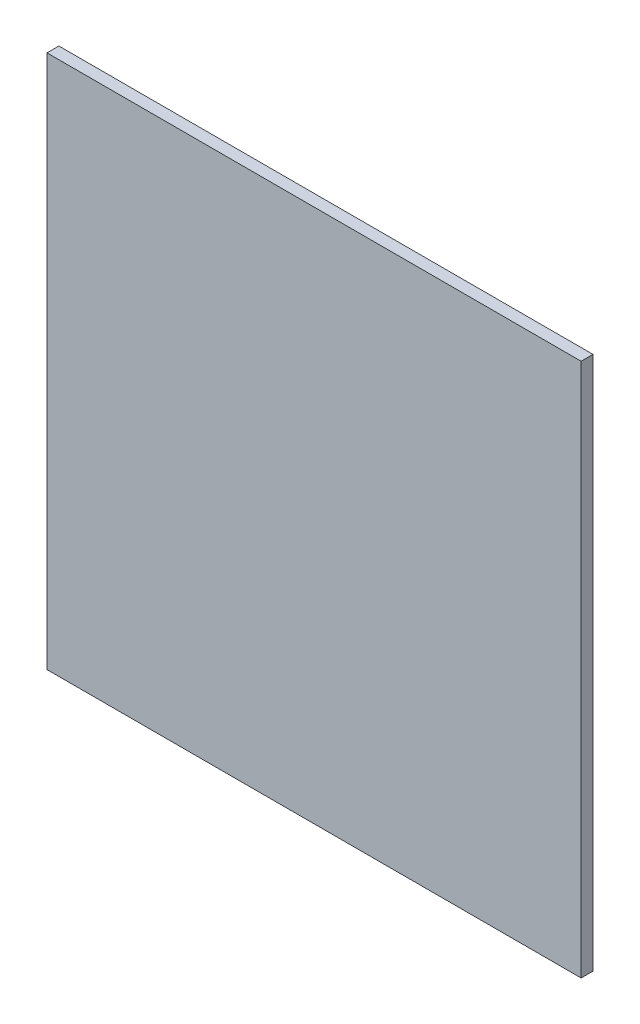
ISO-10303-21;
HEADER;
FILE_DESCRIPTION(('STEP AP214'),'2;1');
FILE_NAME('part.step','',(''),(''),'','','');
FILE_SCHEMA(('AUTOMOTIVE_DESIGN { 1 0 10303 214 1 1 1 1 }'));
ENDSEC;
DATA;
#1=APPLICATION_CONTEXT('core data for automotive mechanical design processes');
#2=APPLICATION_PROTOCOL_DEFINITION('international standard','automotive_design',2000,#1);
#3=PRODUCT_CONTEXT('',#1,'mechanical');
#4=PRODUCT('Part','Part','',(#3));
#5=PRODUCT_RELATED_PRODUCT_CATEGORY('part','',(#4));
#6=PRODUCT_DEFINITION_FORMATION('','',#4);
#7=PRODUCT_DEFINITION_CONTEXT('part definition',#1,'design');
#8=PRODUCT_DEFINITION('design','',#6,#7);
#9=PRODUCT_DEFINITION_SHAPE('','',#8);
#10=(LENGTH_UNIT() NAMED_UNIT(*) SI_UNIT(.MILLI.,.METRE.));
#11=(NAMED_UNIT(*) PLANE_ANGLE_UNIT() SI_UNIT($,.RADIAN.));
#12=(NAMED_UNIT(*) SI_UNIT($,.STERADIAN.) SOLID_ANGLE_UNIT());
#13=UNCERTAINTY_MEASURE_WITH_UNIT(LENGTH_MEASURE(1.E-05),#10,'distance_accuracy_value','');
#14=(GEOMETRIC_REPRESENTATION_CONTEXT(3) GLOBAL_UNCERTAINTY_ASSIGNED_CONTEXT((#13)) GLOBAL_UNIT_ASSIGNED_CONTEXT((#10,
#11,#12)) REPRESENTATION_CONTEXT('',''));
#15=CARTESIAN_POINT('',(0.,0.,0.));
#16=DIRECTION('',(0.,0.,1.));
#17=DIRECTION('',(1.,0.,0.));
#18=AXIS2_PLACEMENT_3D('',#15,#16,#17);
#19=CARTESIAN_POINT('',(22.5,-22.5,1.));
#20=DIRECTION('',(-1.,0.,0.));
#21=DIRECTION('',(0.,0.,1.));
#22=AXIS2_PLACEMENT_3D('',#19,#20,#21);
#23=PLANE('',#22);
#24=DIRECTION('',(0.,1.,0.));
#25=VECTOR('',#24,1.);
#26=CARTESIAN_POINT('',(22.5,-22.5,0.));
#27=LINE('',#26,#25);
#28=CARTESIAN_POINT('',(22.5,-22.5,0.));
#29=VERTEX_POINT('',#28);
#30=CARTESIAN_POINT('',(22.5,22.5,0.));
#31=VERTEX_POINT('',#30);
#32=EDGE_CURVE('E95',#29,#31,#27,.T.);
#33=ORIENTED_EDGE('',*,*,#32,.T.);
#34=DIRECTION('',(0.,0.,-1.));
#35=VECTOR('',#34,1.);
#36=CARTESIAN_POINT('',(22.5,22.5,1.));
#37=LINE('',#36,#35);
#38=CARTESIAN_POINT('',(22.5,22.5,1.));
#39=VERTEX_POINT('',#38);
#40=EDGE_CURVE('E11',#39,#31,#37,.T.);
#41=ORIENTED_EDGE('',*,*,#40,.F.);
#42=DIRECTION('',(0.,1.,0.));
#43=VECTOR('',#42,1.);
#44=CARTESIAN_POINT('',(22.5,-22.5,1.));
#45=LINE('',#44,#43);
#46=CARTESIAN_POINT('',(22.5,-22.5,1.));
#47=VERTEX_POINT('',#46);
#48=EDGE_CURVE('E83',#47,#39,#45,.T.);
#49=ORIENTED_EDGE('',*,*,#48,.F.);
#50=DIRECTION('',(0.,0.,-1.));
#51=VECTOR('',#50,1.);
#52=CARTESIAN_POINT('',(22.5,-22.5,1.));
#53=LINE('',#52,#51);
#54=EDGE_CURVE('E91',#47,#29,#53,.T.);
#55=ORIENTED_EDGE('',*,*,#54,.T.);
#56=EDGE_LOOP('',(#33,#41,#49,#55));
#57=FACE_BOUND('',#56,.T.);
#58=ADVANCED_FACE('F32',(#57),#23,.F.);
#59=CARTESIAN_POINT('',(-22.5,22.5,1.));
#60=DIRECTION('',(0.,-1.,0.));
#61=DIRECTION('',(0.,0.,-1.));
#62=AXIS2_PLACEMENT_3D('',#59,#60,#61);
#63=PLANE('',#62);
#64=DIRECTION('',(-1.,0.,0.));
#65=VECTOR('',#64,1.);
#66=CARTESIAN_POINT('',(-22.5,22.5,0.));
#67=LINE('',#66,#65);
#68=CARTESIAN_POINT('',(-22.5,22.5,0.));
#69=VERTEX_POINT('',#68);
#70=EDGE_CURVE('E87',#31,#69,#67,.T.);
#71=ORIENTED_EDGE('',*,*,#70,.T.);
#72=DIRECTION('',(0.,0.,-1.));
#73=VECTOR('',#72,1.);
#74=CARTESIAN_POINT('',(-22.5,22.5,1.));
#75=LINE('',#74,#73);
#76=CARTESIAN_POINT('',(-22.5,22.5,1.));
#77=VERTEX_POINT('',#76);
#78=EDGE_CURVE('E40',#77,#69,#75,.T.);
#79=ORIENTED_EDGE('',*,*,#78,.F.);
#80=DIRECTION('',(-1.,0.,0.));
#81=VECTOR('',#80,1.);
#82=CARTESIAN_POINT('',(-22.5,22.5,1.));
#83=LINE('',#82,#81);
#84=EDGE_CURVE('E78',#39,#77,#83,.T.);
#85=ORIENTED_EDGE('',*,*,#84,.F.);
#86=ORIENTED_EDGE('',*,*,#40,.T.);
#87=EDGE_LOOP('',(#71,#79,#85,#86));
#88=FACE_BOUND('',#87,.T.);
#89=ADVANCED_FACE('F86',(#88),#63,.F.);
#90=CARTESIAN_POINT('',(-22.5,-22.5,1.));
#91=DIRECTION('',(1.,0.,0.));
#92=DIRECTION('',(0.,0.,-1.));
#93=AXIS2_PLACEMENT_3D('',#90,#91,#92);
#94=PLANE('',#93);
#95=DIRECTION('',(0.,-1.,0.));
#96=VECTOR('',#95,1.);
#97=CARTESIAN_POINT('',(-22.5,-22.5,0.));
#98=LINE('',#97,#96);
#99=CARTESIAN_POINT('',(-22.5,-22.5,0.));
#100=VERTEX_POINT('',#99);
#101=EDGE_CURVE('E65',#69,#100,#98,.T.);
#102=ORIENTED_EDGE('',*,*,#101,.T.);
#103=DIRECTION('',(0.,0.,-1.));
#104=VECTOR('',#103,1.);
#105=CARTESIAN_POINT('',(-22.5,-22.5,1.));
#106=LINE('',#105,#104);
#107=CARTESIAN_POINT('',(-22.5,-22.5,1.));
#108=VERTEX_POINT('',#107);
#109=EDGE_CURVE('E88',#108,#100,#106,.T.);
#110=ORIENTED_EDGE('',*,*,#109,.F.);
#111=DIRECTION('',(0.,-1.,0.));
#112=VECTOR('',#111,1.);
#113=CARTESIAN_POINT('',(-22.5,-22.5,1.));
#114=LINE('',#113,#112);
#115=EDGE_CURVE('E81',#77,#108,#114,.T.);
#116=ORIENTED_EDGE('',*,*,#115,.F.);
#117=ORIENTED_EDGE('',*,*,#78,.T.);
#118=EDGE_LOOP('',(#102,#110,#116,#117));
#119=FACE_BOUND('',#118,.T.);
#120=ADVANCED_FACE('F89',(#119),#94,.F.);
#121=CARTESIAN_POINT('',(-22.5,-22.5,1.));
#122=DIRECTION('',(0.,1.,0.));
#123=DIRECTION('',(0.,0.,1.));
#124=AXIS2_PLACEMENT_3D('',#121,#122,#123);
#125=PLANE('',#124);
#126=DIRECTION('',(1.,0.,0.));
#127=VECTOR('',#126,1.);
#128=CARTESIAN_POINT('',(-22.5,-22.5,0.));
#129=LINE('',#128,#127);
#130=EDGE_CURVE('E71',#100,#29,#129,.T.);
#131=ORIENTED_EDGE('',*,*,#130,.T.);
#132=ORIENTED_EDGE('',*,*,#54,.F.);
#133=DIRECTION('',(1.,0.,0.));
#134=VECTOR('',#133,1.);
#135=CARTESIAN_POINT('',(-22.5,-22.5,1.));
#136=LINE('',#135,#134);
#137=EDGE_CURVE('E48',#108,#47,#136,.T.);
#138=ORIENTED_EDGE('',*,*,#137,.F.);
#139=ORIENTED_EDGE('',*,*,#109,.T.);
#140=EDGE_LOOP('',(#131,#132,#138,#139));
#141=FACE_BOUND('',#140,.T.);
#142=ADVANCED_FACE('F102',(#141),#125,.F.);
#143=CARTESIAN_POINT('',(22.5,22.5,1.));
#144=DIRECTION('',(0.,0.,-1.));
#145=DIRECTION('',(-1.,0.,0.));
#146=AXIS2_PLACEMENT_3D('',#143,#144,#145);
#147=PLANE('',#146);
#148=ORIENTED_EDGE('',*,*,#48,.T.);
#149=ORIENTED_EDGE('',*,*,#84,.T.);
#150=ORIENTED_EDGE('',*,*,#115,.T.);
#151=ORIENTED_EDGE('',*,*,#137,.T.);
#152=EDGE_LOOP('',(#148,#149,#150,#151));
#153=FACE_BOUND('',#152,.T.);
#154=ADVANCED_FACE('F79',(#153),#147,.F.);
#155=CARTESIAN_POINT('',(22.5,22.5,0.));
#156=DIRECTION('',(0.,0.,-1.));
#157=DIRECTION('',(-1.,0.,0.));
#158=AXIS2_PLACEMENT_3D('',#155,#156,#157);
#159=PLANE('',#158);
#160=ORIENTED_EDGE('',*,*,#32,.F.);
#161=ORIENTED_EDGE('',*,*,#130,.F.);
#162=ORIENTED_EDGE('',*,*,#101,.F.);
#163=ORIENTED_EDGE('',*,*,#70,.F.);
#164=EDGE_LOOP('',(#160,#161,#162,#163));
#165=FACE_BOUND('',#164,.T.);
#166=ADVANCED_FACE('F105',(#165),#159,.T.);
#167=CLOSED_SHELL('',(#58,#89,#120,#142,#154,#166));
#168=MANIFOLD_SOLID_BREP('B2',#167);
#169=ADVANCED_BREP_SHAPE_REPRESENTATION('',(#18,#168),#14);
#170=SHAPE_DEFINITION_REPRESENTATION(#9,#169);
ENDSEC;
END-ISO-10303-21;
